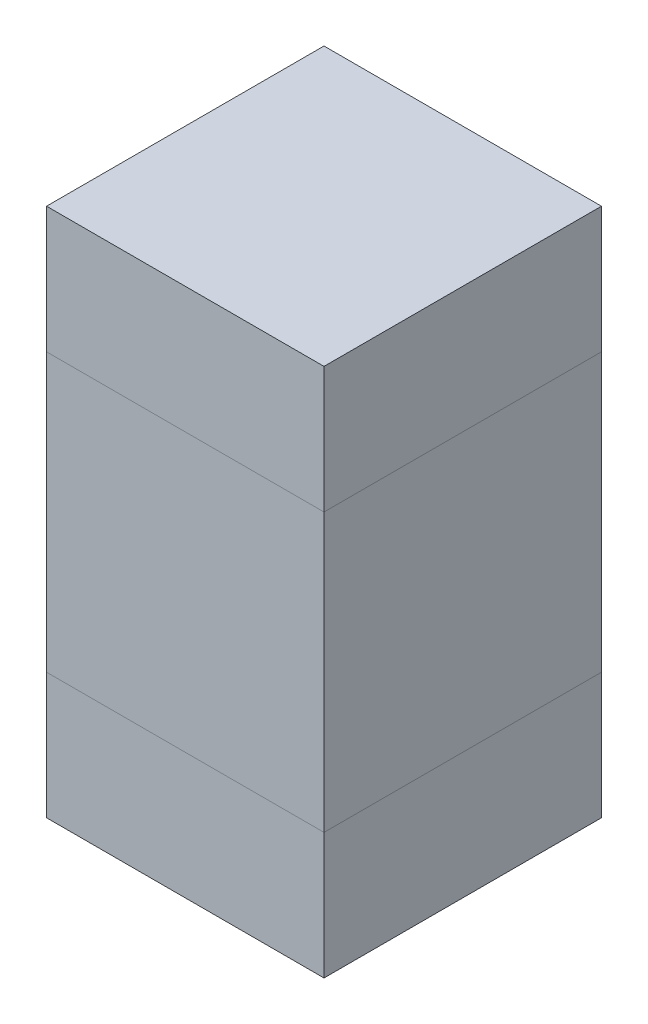
ISO-10303-21;
HEADER;
FILE_DESCRIPTION(('STEP AP214'),'2;1');
FILE_NAME('part.step','',(''),(''),'','','');
FILE_SCHEMA(('AUTOMOTIVE_DESIGN { 1 0 10303 214 1 1 1 1 }'));
ENDSEC;
DATA;
#1=APPLICATION_CONTEXT('core data for automotive mechanical design processes');
#2=APPLICATION_PROTOCOL_DEFINITION('international standard','automotive_design',2000,#1);
#3=PRODUCT_CONTEXT('',#1,'mechanical');
#4=PRODUCT('Part','Part','',(#3));
#5=PRODUCT_RELATED_PRODUCT_CATEGORY('part','',(#4));
#6=PRODUCT_DEFINITION_FORMATION('','',#4);
#7=PRODUCT_DEFINITION_CONTEXT('part definition',#1,'design');
#8=PRODUCT_DEFINITION('design','',#6,#7);
#9=PRODUCT_DEFINITION_SHAPE('','',#8);
#10=(LENGTH_UNIT() NAMED_UNIT(*) SI_UNIT(.MILLI.,.METRE.));
#11=(NAMED_UNIT(*) PLANE_ANGLE_UNIT() SI_UNIT($,.RADIAN.));
#12=(NAMED_UNIT(*) SI_UNIT($,.STERADIAN.) SOLID_ANGLE_UNIT());
#13=UNCERTAINTY_MEASURE_WITH_UNIT(LENGTH_MEASURE(1.E-05),#10,'distance_accuracy_value','');
#14=(GEOMETRIC_REPRESENTATION_CONTEXT(3) GLOBAL_UNCERTAINTY_ASSIGNED_CONTEXT((#13)) GLOBAL_UNIT_ASSIGNED_CONTEXT((#10,
#11,#12)) REPRESENTATION_CONTEXT('',''));
#15=CARTESIAN_POINT('',(0.,0.,0.));
#16=DIRECTION('',(0.,0.,1.));
#17=DIRECTION('',(1.,0.,0.));
#18=AXIS2_PLACEMENT_3D('',#15,#16,#17);
#19=CARTESIAN_POINT('',(1.210000129453,5.735003442305,0.32999934));
#20=DIRECTION('',(0.,0.,-1.));
#21=DIRECTION('',(0.,-1.,0.));
#22=AXIS2_PLACEMENT_3D('',#19,#20,#21);
#23=PLANE('',#22);
#24=DIRECTION('',(1.,0.,0.));
#25=VECTOR('',#24,1.);
#26=CARTESIAN_POINT('',(1.210000129453,5.735003442305,0.32999934));
#27=LINE('',#26,#25);
#28=CARTESIAN_POINT('',(1.210000129453,5.735003442305,0.32999934));
#29=VERTEX_POINT('',#28);
#30=CARTESIAN_POINT('',(1.540002009453,5.735003442305,0.32999934));
#31=VERTEX_POINT('',#30);
#32=EDGE_CURVE('P0_E82',#29,#31,#27,.T.);
#33=ORIENTED_EDGE('',*,*,#32,.T.);
#34=DIRECTION('',(0.,1.,0.));
#35=VECTOR('',#34,1.);
#36=CARTESIAN_POINT('',(1.540002009453,5.735003442305,0.32999934));
#37=LINE('',#36,#35);
#38=CARTESIAN_POINT('',(1.540002009453,5.885003142305,0.32999934));
#39=VERTEX_POINT('',#38);
#40=EDGE_CURVE('P0_E109',#31,#39,#37,.T.);
#41=ORIENTED_EDGE('',*,*,#40,.T.);
#42=DIRECTION('',(-1.,0.,0.));
#43=VECTOR('',#42,1.);
#44=CARTESIAN_POINT('',(1.540002009453,5.885003142305,0.32999934));
#45=LINE('',#44,#43);
#46=CARTESIAN_POINT('',(1.210000129453,5.885003142305,0.32999934));
#47=VERTEX_POINT('',#46);
#48=EDGE_CURVE('P0_E74',#39,#47,#45,.T.);
#49=ORIENTED_EDGE('',*,*,#48,.T.);
#50=DIRECTION('',(0.,-1.,0.));
#51=VECTOR('',#50,1.);
#52=CARTESIAN_POINT('',(1.210000129453,5.885003142305,0.32999934));
#53=LINE('',#52,#51);
#54=EDGE_CURVE('P0_E11',#47,#29,#53,.T.);
#55=ORIENTED_EDGE('',*,*,#54,.T.);
#56=EDGE_LOOP('',(#33,#41,#49,#55));
#57=FACE_BOUND('',#56,.T.);
#58=ADVANCED_FACE('P0_F17',(#57),#23,.F.);
#59=CARTESIAN_POINT('',(1.210000129453,5.735003442305,0.));
#60=DIRECTION('',(0.,0.,-1.));
#61=DIRECTION('',(0.,-1.,0.));
#62=AXIS2_PLACEMENT_3D('',#59,#60,#61);
#63=PLANE('',#62);
#64=DIRECTION('',(0.,-1.,0.));
#65=VECTOR('',#64,1.);
#66=CARTESIAN_POINT('',(1.210000129453,5.885003142305,0.));
#67=LINE('',#66,#65);
#68=CARTESIAN_POINT('',(1.210000129453,5.885003142305,0.));
#69=VERTEX_POINT('',#68);
#70=CARTESIAN_POINT('',(1.210000129453,5.735003442305,0.));
#71=VERTEX_POINT('',#70);
#72=EDGE_CURVE('P0_E25',#69,#71,#67,.T.);
#73=ORIENTED_EDGE('',*,*,#72,.F.);
#74=DIRECTION('',(-1.,0.,0.));
#75=VECTOR('',#74,1.);
#76=CARTESIAN_POINT('',(1.540002009453,5.885003142305,0.));
#77=LINE('',#76,#75);
#78=CARTESIAN_POINT('',(1.540002009453,5.885003142305,0.));
#79=VERTEX_POINT('',#78);
#80=EDGE_CURVE('P0_E102',#79,#69,#77,.T.);
#81=ORIENTED_EDGE('',*,*,#80,.F.);
#82=DIRECTION('',(0.,1.,0.));
#83=VECTOR('',#82,1.);
#84=CARTESIAN_POINT('',(1.540002009453,5.735003442305,0.));
#85=LINE('',#84,#83);
#86=CARTESIAN_POINT('',(1.540002009453,5.735003442305,0.));
#87=VERTEX_POINT('',#86);
#88=EDGE_CURVE('P0_E84',#87,#79,#85,.T.);
#89=ORIENTED_EDGE('',*,*,#88,.F.);
#90=DIRECTION('',(1.,0.,0.));
#91=VECTOR('',#90,1.);
#92=CARTESIAN_POINT('',(1.210000129453,5.735003442305,0.));
#93=LINE('',#92,#91);
#94=EDGE_CURVE('P0_E80',#71,#87,#93,.T.);
#95=ORIENTED_EDGE('',*,*,#94,.F.);
#96=EDGE_LOOP('',(#73,#81,#89,#95));
#97=FACE_BOUND('',#96,.T.);
#98=ADVANCED_FACE('P0_F86',(#97),#63,.T.);
#99=CARTESIAN_POINT('',(1.210000129453,5.885003142305,0.));
#100=DIRECTION('',(1.,0.,0.));
#101=DIRECTION('',(0.,1.,0.));
#102=AXIS2_PLACEMENT_3D('',#99,#100,#101);
#103=PLANE('',#102);
#104=ORIENTED_EDGE('',*,*,#72,.T.);
#105=DIRECTION('',(0.,0.,1.));
#106=VECTOR('',#105,1.);
#107=CARTESIAN_POINT('',(1.210000129453,5.735003442305,0.));
#108=LINE('',#107,#106);
#109=EDGE_CURVE('P0_E68',#71,#29,#108,.T.);
#110=ORIENTED_EDGE('',*,*,#109,.T.);
#111=ORIENTED_EDGE('',*,*,#54,.F.);
#112=DIRECTION('',(0.,0.,1.));
#113=VECTOR('',#112,1.);
#114=CARTESIAN_POINT('',(1.210000129453,5.885003142305,0.));
#115=LINE('',#114,#113);
#116=EDGE_CURVE('P0_E71',#69,#47,#115,.T.);
#117=ORIENTED_EDGE('',*,*,#116,.F.);
#118=EDGE_LOOP('',(#104,#110,#111,#117));
#119=FACE_BOUND('',#118,.T.);
#120=ADVANCED_FACE('P0_F67',(#119),#103,.F.);
#121=CARTESIAN_POINT('',(1.540002009453,5.885003142305,0.));
#122=DIRECTION('',(0.,-1.,0.));
#123=DIRECTION('',(0.,0.,-1.));
#124=AXIS2_PLACEMENT_3D('',#121,#122,#123);
#125=PLANE('',#124);
#126=ORIENTED_EDGE('',*,*,#80,.T.);
#127=ORIENTED_EDGE('',*,*,#116,.T.);
#128=ORIENTED_EDGE('',*,*,#48,.F.);
#129=DIRECTION('',(0.,0.,1.));
#130=VECTOR('',#129,1.);
#131=CARTESIAN_POINT('',(1.540002009453,5.885003142305,0.));
#132=LINE('',#131,#130);
#133=EDGE_CURVE('P0_E105',#79,#39,#132,.T.);
#134=ORIENTED_EDGE('',*,*,#133,.F.);
#135=EDGE_LOOP('',(#126,#127,#128,#134));
#136=FACE_BOUND('',#135,.T.);
#137=ADVANCED_FACE('P0_F116',(#136),#125,.F.);
#138=CARTESIAN_POINT('',(1.540002009453,5.735003442305,0.));
#139=DIRECTION('',(-1.,0.,0.));
#140=DIRECTION('',(0.,0.,1.));
#141=AXIS2_PLACEMENT_3D('',#138,#139,#140);
#142=PLANE('',#141);
#143=ORIENTED_EDGE('',*,*,#88,.T.);
#144=ORIENTED_EDGE('',*,*,#133,.T.);
#145=ORIENTED_EDGE('',*,*,#40,.F.);
#146=DIRECTION('',(0.,0.,1.));
#147=VECTOR('',#146,1.);
#148=CARTESIAN_POINT('',(1.540002009453,5.735003442305,0.));
#149=LINE('',#148,#147);
#150=EDGE_CURVE('P0_E90',#87,#31,#149,.T.);
#151=ORIENTED_EDGE('',*,*,#150,.F.);
#152=EDGE_LOOP('',(#143,#144,#145,#151));
#153=FACE_BOUND('',#152,.T.);
#154=ADVANCED_FACE('P0_F118',(#153),#142,.F.);
#155=CARTESIAN_POINT('',(1.210000129453,5.735003442305,0.));
#156=DIRECTION('',(0.,1.,0.));
#157=DIRECTION('',(1.,0.,0.));
#158=AXIS2_PLACEMENT_3D('',#155,#156,#157);
#159=PLANE('',#158);
#160=ORIENTED_EDGE('',*,*,#94,.T.);
#161=ORIENTED_EDGE('',*,*,#150,.T.);
#162=ORIENTED_EDGE('',*,*,#32,.F.);
#163=ORIENTED_EDGE('',*,*,#109,.F.);
#164=EDGE_LOOP('',(#160,#161,#162,#163));
#165=FACE_BOUND('',#164,.T.);
#166=ADVANCED_FACE('P0_F78',(#165),#159,.F.);
#167=CLOSED_SHELL('',(#58,#98,#120,#137,#154,#166));
#168=MANIFOLD_SOLID_BREP('P0_B1',#167);
#169=CARTESIAN_POINT('',(1.210000129453,6.214999169844,0.32999934));
#170=DIRECTION('',(0.,0.,-1.));
#171=DIRECTION('',(0.,-1.,0.));
#172=AXIS2_PLACEMENT_3D('',#169,#170,#171);
#173=PLANE('',#172);
#174=DIRECTION('',(1.,0.,0.));
#175=VECTOR('',#174,1.);
#176=CARTESIAN_POINT('',(1.210000129453,6.214999169844,0.32999934));
#177=LINE('',#176,#175);
#178=CARTESIAN_POINT('',(1.210000129453,6.214999169844,0.32999934));
#179=VERTEX_POINT('',#178);
#180=CARTESIAN_POINT('',(1.540002009453,6.214999169844,0.32999934));
#181=VERTEX_POINT('',#180);
#182=EDGE_CURVE('P1_E82',#179,#181,#177,.T.);
#183=ORIENTED_EDGE('',*,*,#182,.T.);
#184=DIRECTION('',(0.,1.,0.));
#185=VECTOR('',#184,1.);
#186=CARTESIAN_POINT('',(1.540002009453,6.214999169844,0.32999934));
#187=LINE('',#186,#185);
#188=CARTESIAN_POINT('',(1.540002009453,6.364998869844,0.32999934));
#189=VERTEX_POINT('',#188);
#190=EDGE_CURVE('P1_E104',#181,#189,#187,.T.);
#191=ORIENTED_EDGE('',*,*,#190,.T.);
#192=DIRECTION('',(-1.,0.,0.));
#193=VECTOR('',#192,1.);
#194=CARTESIAN_POINT('',(1.540002009453,6.364998869844,0.32999934));
#195=LINE('',#194,#193);
#196=CARTESIAN_POINT('',(1.210000129453,6.364998869844,0.32999934));
#197=VERTEX_POINT('',#196);
#198=EDGE_CURVE('P1_E74',#189,#197,#195,.T.);
#199=ORIENTED_EDGE('',*,*,#198,.T.);
#200=DIRECTION('',(0.,-1.,0.));
#201=VECTOR('',#200,1.);
#202=CARTESIAN_POINT('',(1.210000129453,6.364998869844,0.32999934));
#203=LINE('',#202,#201);
#204=EDGE_CURVE('P1_E11',#197,#179,#203,.T.);
#205=ORIENTED_EDGE('',*,*,#204,.T.);
#206=EDGE_LOOP('',(#183,#191,#199,#205));
#207=FACE_BOUND('',#206,.T.);
#208=ADVANCED_FACE('P1_F17',(#207),#173,.F.);
#209=CARTESIAN_POINT('',(1.210000129453,6.214999169844,0.));
#210=DIRECTION('',(0.,0.,-1.));
#211=DIRECTION('',(0.,-1.,0.));
#212=AXIS2_PLACEMENT_3D('',#209,#210,#211);
#213=PLANE('',#212);
#214=DIRECTION('',(0.,-1.,0.));
#215=VECTOR('',#214,1.);
#216=CARTESIAN_POINT('',(1.210000129453,6.364998869844,0.));
#217=LINE('',#216,#215);
#218=CARTESIAN_POINT('',(1.210000129453,6.364998869844,0.));
#219=VERTEX_POINT('',#218);
#220=CARTESIAN_POINT('',(1.210000129453,6.214999169844,0.));
#221=VERTEX_POINT('',#220);
#222=EDGE_CURVE('P1_E25',#219,#221,#217,.T.);
#223=ORIENTED_EDGE('',*,*,#222,.F.);
#224=DIRECTION('',(-1.,0.,0.));
#225=VECTOR('',#224,1.);
#226=CARTESIAN_POINT('',(1.540002009453,6.364998869844,0.));
#227=LINE('',#226,#225);
#228=CARTESIAN_POINT('',(1.540002009453,6.364998869844,0.));
#229=VERTEX_POINT('',#228);
#230=EDGE_CURVE('P1_E108',#229,#219,#227,.T.);
#231=ORIENTED_EDGE('',*,*,#230,.F.);
#232=DIRECTION('',(0.,1.,0.));
#233=VECTOR('',#232,1.);
#234=CARTESIAN_POINT('',(1.540002009453,6.214999169844,0.));
#235=LINE('',#234,#233);
#236=CARTESIAN_POINT('',(1.540002009453,6.214999169844,0.));
#237=VERTEX_POINT('',#236);
#238=EDGE_CURVE('P1_E84',#237,#229,#235,.T.);
#239=ORIENTED_EDGE('',*,*,#238,.F.);
#240=DIRECTION('',(1.,0.,0.));
#241=VECTOR('',#240,1.);
#242=CARTESIAN_POINT('',(1.210000129453,6.214999169844,0.));
#243=LINE('',#242,#241);
#244=EDGE_CURVE('P1_E80',#221,#237,#243,.T.);
#245=ORIENTED_EDGE('',*,*,#244,.F.);
#246=EDGE_LOOP('',(#223,#231,#239,#245));
#247=FACE_BOUND('',#246,.T.);
#248=ADVANCED_FACE('P1_F86',(#247),#213,.T.);
#249=CARTESIAN_POINT('',(1.210000129453,6.364998869844,0.));
#250=DIRECTION('',(1.,0.,0.));
#251=DIRECTION('',(0.,1.,0.));
#252=AXIS2_PLACEMENT_3D('',#249,#250,#251);
#253=PLANE('',#252);
#254=ORIENTED_EDGE('',*,*,#222,.T.);
#255=DIRECTION('',(0.,0.,1.));
#256=VECTOR('',#255,1.);
#257=CARTESIAN_POINT('',(1.210000129453,6.214999169844,0.));
#258=LINE('',#257,#256);
#259=EDGE_CURVE('P1_E68',#221,#179,#258,.T.);
#260=ORIENTED_EDGE('',*,*,#259,.T.);
#261=ORIENTED_EDGE('',*,*,#204,.F.);
#262=DIRECTION('',(0.,0.,1.));
#263=VECTOR('',#262,1.);
#264=CARTESIAN_POINT('',(1.210000129453,6.364998869844,0.));
#265=LINE('',#264,#263);
#266=EDGE_CURVE('P1_E71',#219,#197,#265,.T.);
#267=ORIENTED_EDGE('',*,*,#266,.F.);
#268=EDGE_LOOP('',(#254,#260,#261,#267));
#269=FACE_BOUND('',#268,.T.);
#270=ADVANCED_FACE('P1_F67',(#269),#253,.F.);
#271=CARTESIAN_POINT('',(1.540002009453,6.364998869844,0.));
#272=DIRECTION('',(0.,-1.,0.));
#273=DIRECTION('',(0.,0.,-1.));
#274=AXIS2_PLACEMENT_3D('',#271,#272,#273);
#275=PLANE('',#274);
#276=ORIENTED_EDGE('',*,*,#230,.T.);
#277=ORIENTED_EDGE('',*,*,#266,.T.);
#278=ORIENTED_EDGE('',*,*,#198,.F.);
#279=DIRECTION('',(0.,0.,1.));
#280=VECTOR('',#279,1.);
#281=CARTESIAN_POINT('',(1.540002009453,6.364998869844,0.));
#282=LINE('',#281,#280);
#283=EDGE_CURVE('P1_E100',#229,#189,#282,.T.);
#284=ORIENTED_EDGE('',*,*,#283,.F.);
#285=EDGE_LOOP('',(#276,#277,#278,#284));
#286=FACE_BOUND('',#285,.T.);
#287=ADVANCED_FACE('P1_F117',(#286),#275,.F.);
#288=CARTESIAN_POINT('',(1.540002009453,6.214999169844,0.));
#289=DIRECTION('',(-1.,0.,0.));
#290=DIRECTION('',(0.,0.,1.));
#291=AXIS2_PLACEMENT_3D('',#288,#289,#290);
#292=PLANE('',#291);
#293=ORIENTED_EDGE('',*,*,#238,.T.);
#294=ORIENTED_EDGE('',*,*,#283,.T.);
#295=ORIENTED_EDGE('',*,*,#190,.F.);
#296=DIRECTION('',(0.,0.,1.));
#297=VECTOR('',#296,1.);
#298=CARTESIAN_POINT('',(1.540002009453,6.214999169844,0.));
#299=LINE('',#298,#297);
#300=EDGE_CURVE('P1_E90',#237,#181,#299,.T.);
#301=ORIENTED_EDGE('',*,*,#300,.F.);
#302=EDGE_LOOP('',(#293,#294,#295,#301));
#303=FACE_BOUND('',#302,.T.);
#304=ADVANCED_FACE('P1_F119',(#303),#292,.F.);
#305=CARTESIAN_POINT('',(1.210000129453,6.214999169844,0.));
#306=DIRECTION('',(0.,1.,0.));
#307=DIRECTION('',(1.,0.,0.));
#308=AXIS2_PLACEMENT_3D('',#305,#306,#307);
#309=PLANE('',#308);
#310=ORIENTED_EDGE('',*,*,#244,.T.);
#311=ORIENTED_EDGE('',*,*,#300,.T.);
#312=ORIENTED_EDGE('',*,*,#182,.F.);
#313=ORIENTED_EDGE('',*,*,#259,.F.);
#314=EDGE_LOOP('',(#310,#311,#312,#313));
#315=FACE_BOUND('',#314,.T.);
#316=ADVANCED_FACE('P1_F78',(#315),#309,.F.);
#317=CLOSED_SHELL('',(#208,#248,#270,#287,#304,#316));
#318=MANIFOLD_SOLID_BREP('P1_B1',#317);
#319=CARTESIAN_POINT('',(1.540002009453,5.884998946074,0.32999934));
#320=DIRECTION('',(0.,0.,-1.));
#321=DIRECTION('',(0.,-1.,0.));
#322=AXIS2_PLACEMENT_3D('',#319,#320,#321);
#323=PLANE('',#322);
#324=DIRECTION('',(0.,1.,0.));
#325=VECTOR('',#324,1.);
#326=CARTESIAN_POINT('',(1.540002009453,5.884998946074,0.32999934));
#327=LINE('',#326,#325);
#328=CARTESIAN_POINT('',(1.540002009453,5.884998946074,0.32999934));
#329=VERTEX_POINT('',#328);
#330=CARTESIAN_POINT('',(1.540002009453,6.215000826074,0.32999934));
#331=VERTEX_POINT('',#330);
#332=EDGE_CURVE('P2_E72',#329,#331,#327,.T.);
#333=ORIENTED_EDGE('',*,*,#332,.T.);
#334=DIRECTION('',(-1.,0.,0.));
#335=VECTOR('',#334,1.);
#336=CARTESIAN_POINT('',(1.540002009453,6.215000826074,0.32999934));
#337=LINE('',#336,#335);
#338=CARTESIAN_POINT('',(1.210002669453,6.215000826074,0.32999934));
#339=VERTEX_POINT('',#338);
#340=EDGE_CURVE('P2_E101',#331,#339,#337,.T.);
#341=ORIENTED_EDGE('',*,*,#340,.T.);
#342=DIRECTION('',(0.,-1.,0.));
#343=VECTOR('',#342,1.);
#344=CARTESIAN_POINT('',(1.210002669453,6.215000826074,0.32999934));
#345=LINE('',#344,#343);
#346=CARTESIAN_POINT('',(1.210002669453,5.884998946074,0.32999934));
#347=VERTEX_POINT('',#346);
#348=EDGE_CURVE('P2_E20',#339,#347,#345,.T.);
#349=ORIENTED_EDGE('',*,*,#348,.T.);
#350=DIRECTION('',(1.,0.,0.));
#351=VECTOR('',#350,1.);
#352=CARTESIAN_POINT('',(1.210002669453,5.884998946074,0.32999934));
#353=LINE('',#352,#351);
#354=EDGE_CURVE('P2_E11',#347,#329,#353,.T.);
#355=ORIENTED_EDGE('',*,*,#354,.T.);
#356=EDGE_LOOP('',(#333,#341,#349,#355));
#357=FACE_BOUND('',#356,.T.);
#358=ADVANCED_FACE('P2_F17',(#357),#323,.F.);
#359=CARTESIAN_POINT('',(1.540002009453,5.884998946074,0.));
#360=DIRECTION('',(0.,0.,-1.));
#361=DIRECTION('',(0.,-1.,0.));
#362=AXIS2_PLACEMENT_3D('',#359,#360,#361);
#363=PLANE('',#362);
#364=DIRECTION('',(1.,0.,0.));
#365=VECTOR('',#364,1.);
#366=CARTESIAN_POINT('',(1.210002669453,5.884998946074,0.));
#367=LINE('',#366,#365);
#368=CARTESIAN_POINT('',(1.210002669453,5.884998946074,0.));
#369=VERTEX_POINT('',#368);
#370=CARTESIAN_POINT('',(1.540002009453,5.884998946074,0.));
#371=VERTEX_POINT('',#370);
#372=EDGE_CURVE('P2_E26',#369,#371,#367,.T.);
#373=ORIENTED_EDGE('',*,*,#372,.F.);
#374=DIRECTION('',(0.,-1.,0.));
#375=VECTOR('',#374,1.);
#376=CARTESIAN_POINT('',(1.210002669453,6.215000826074,0.));
#377=LINE('',#376,#375);
#378=CARTESIAN_POINT('',(1.210002669453,6.215000826074,0.));
#379=VERTEX_POINT('',#378);
#380=EDGE_CURVE('P2_E103',#379,#369,#377,.T.);
#381=ORIENTED_EDGE('',*,*,#380,.F.);
#382=DIRECTION('',(-1.,0.,0.));
#383=VECTOR('',#382,1.);
#384=CARTESIAN_POINT('',(1.540002009453,6.215000826074,0.));
#385=LINE('',#384,#383);
#386=CARTESIAN_POINT('',(1.540002009453,6.215000826074,0.));
#387=VERTEX_POINT('',#386);
#388=EDGE_CURVE('P2_E81',#387,#379,#385,.T.);
#389=ORIENTED_EDGE('',*,*,#388,.F.);
#390=DIRECTION('',(0.,1.,0.));
#391=VECTOR('',#390,1.);
#392=CARTESIAN_POINT('',(1.540002009453,5.884998946074,0.));
#393=LINE('',#392,#391);
#394=EDGE_CURVE('P2_E90',#371,#387,#393,.T.);
#395=ORIENTED_EDGE('',*,*,#394,.F.);
#396=EDGE_LOOP('',(#373,#381,#389,#395));
#397=FACE_BOUND('',#396,.T.);
#398=ADVANCED_FACE('P2_F118',(#397),#363,.T.);
#399=CARTESIAN_POINT('',(1.210002669453,5.884998946074,0.));
#400=DIRECTION('',(0.,1.,0.));
#401=DIRECTION('',(1.,0.,0.));
#402=AXIS2_PLACEMENT_3D('',#399,#400,#401);
#403=PLANE('',#402);
#404=ORIENTED_EDGE('',*,*,#372,.T.);
#405=DIRECTION('',(0.,0.,1.));
#406=VECTOR('',#405,1.);
#407=CARTESIAN_POINT('',(1.540002009453,5.884998946074,0.));
#408=LINE('',#407,#406);
#409=EDGE_CURVE('P2_E76',#371,#329,#408,.T.);
#410=ORIENTED_EDGE('',*,*,#409,.T.);
#411=ORIENTED_EDGE('',*,*,#354,.F.);
#412=DIRECTION('',(0.,0.,1.));
#413=VECTOR('',#412,1.);
#414=CARTESIAN_POINT('',(1.210002669453,5.884998946074,0.));
#415=LINE('',#414,#413);
#416=EDGE_CURVE('P2_E104',#369,#347,#415,.T.);
#417=ORIENTED_EDGE('',*,*,#416,.F.);
#418=EDGE_LOOP('',(#404,#410,#411,#417));
#419=FACE_BOUND('',#418,.T.);
#420=ADVANCED_FACE('P2_F77',(#419),#403,.F.);
#421=CARTESIAN_POINT('',(1.210002669453,6.215000826074,0.));
#422=DIRECTION('',(1.,0.,0.));
#423=DIRECTION('',(0.,1.,0.));
#424=AXIS2_PLACEMENT_3D('',#421,#422,#423);
#425=PLANE('',#424);
#426=ORIENTED_EDGE('',*,*,#380,.T.);
#427=ORIENTED_EDGE('',*,*,#416,.T.);
#428=ORIENTED_EDGE('',*,*,#348,.F.);
#429=DIRECTION('',(0.,0.,1.));
#430=VECTOR('',#429,1.);
#431=CARTESIAN_POINT('',(1.210002669453,6.215000826074,0.));
#432=LINE('',#431,#430);
#433=EDGE_CURVE('P2_E97',#379,#339,#432,.T.);
#434=ORIENTED_EDGE('',*,*,#433,.F.);
#435=EDGE_LOOP('',(#426,#427,#428,#434));
#436=FACE_BOUND('',#435,.T.);
#437=ADVANCED_FACE('P2_F121',(#436),#425,.F.);
#438=CARTESIAN_POINT('',(1.540002009453,6.215000826074,0.));
#439=DIRECTION('',(0.,-1.,0.));
#440=DIRECTION('',(0.,0.,-1.));
#441=AXIS2_PLACEMENT_3D('',#438,#439,#440);
#442=PLANE('',#441);
#443=ORIENTED_EDGE('',*,*,#388,.T.);
#444=ORIENTED_EDGE('',*,*,#433,.T.);
#445=ORIENTED_EDGE('',*,*,#340,.F.);
#446=DIRECTION('',(0.,0.,1.));
#447=VECTOR('',#446,1.);
#448=CARTESIAN_POINT('',(1.540002009453,6.215000826074,0.));
#449=LINE('',#448,#447);
#450=EDGE_CURVE('P2_E85',#387,#331,#449,.T.);
#451=ORIENTED_EDGE('',*,*,#450,.F.);
#452=EDGE_LOOP('',(#443,#444,#445,#451));
#453=FACE_BOUND('',#452,.T.);
#454=ADVANCED_FACE('P2_F120',(#453),#442,.F.);
#455=CARTESIAN_POINT('',(1.540002009453,5.884998946074,0.));
#456=DIRECTION('',(-1.,0.,0.));
#457=DIRECTION('',(0.,0.,1.));
#458=AXIS2_PLACEMENT_3D('',#455,#456,#457);
#459=PLANE('',#458);
#460=ORIENTED_EDGE('',*,*,#394,.T.);
#461=ORIENTED_EDGE('',*,*,#450,.T.);
#462=ORIENTED_EDGE('',*,*,#332,.F.);
#463=ORIENTED_EDGE('',*,*,#409,.F.);
#464=EDGE_LOOP('',(#460,#461,#462,#463));
#465=FACE_BOUND('',#464,.T.);
#466=ADVANCED_FACE('P2_F83',(#465),#459,.F.);
#467=CLOSED_SHELL('',(#358,#398,#420,#437,#454,#466));
#468=MANIFOLD_SOLID_BREP('P2_B1',#467);
#469=ADVANCED_BREP_SHAPE_REPRESENTATION('',(#18,#168,#318,#468),#14);
#470=SHAPE_DEFINITION_REPRESENTATION(#9,#469);
ENDSEC;
END-ISO-10303-21;
